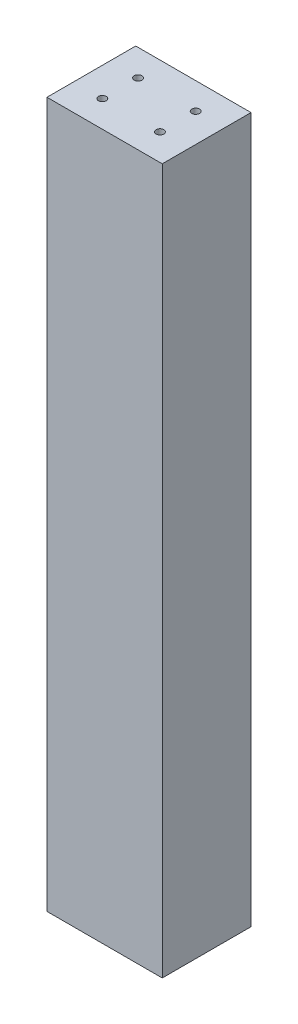
ISO-10303-21;
HEADER;
FILE_DESCRIPTION(('STEP AP214'),'2;1');
FILE_NAME('part.step','',(''),(''),'','','');
FILE_SCHEMA(('AUTOMOTIVE_DESIGN { 1 0 10303 214 1 1 1 1 }'));
ENDSEC;
DATA;
#1=APPLICATION_CONTEXT('core data for automotive mechanical design processes');
#2=APPLICATION_PROTOCOL_DEFINITION('international standard','automotive_design',2000,#1);
#3=PRODUCT_CONTEXT('',#1,'mechanical');
#4=PRODUCT('Part','Part','',(#3));
#5=PRODUCT_RELATED_PRODUCT_CATEGORY('part','',(#4));
#6=PRODUCT_DEFINITION_FORMATION('','',#4);
#7=PRODUCT_DEFINITION_CONTEXT('part definition',#1,'design');
#8=PRODUCT_DEFINITION('design','',#6,#7);
#9=PRODUCT_DEFINITION_SHAPE('','',#8);
#10=(LENGTH_UNIT() NAMED_UNIT(*) SI_UNIT(.MILLI.,.METRE.));
#11=(NAMED_UNIT(*) PLANE_ANGLE_UNIT() SI_UNIT($,.RADIAN.));
#12=(NAMED_UNIT(*) SI_UNIT($,.STERADIAN.) SOLID_ANGLE_UNIT());
#13=UNCERTAINTY_MEASURE_WITH_UNIT(LENGTH_MEASURE(1.E-05),#10,'distance_accuracy_value','');
#14=(GEOMETRIC_REPRESENTATION_CONTEXT(3) GLOBAL_UNCERTAINTY_ASSIGNED_CONTEXT((#13)) GLOBAL_UNIT_ASSIGNED_CONTEXT((#10,
#11,#12)) REPRESENTATION_CONTEXT('',''));
#15=CARTESIAN_POINT('',(0.,0.,0.));
#16=DIRECTION('',(0.,0.,1.));
#17=DIRECTION('',(1.,0.,0.));
#18=AXIS2_PLACEMENT_3D('',#15,#16,#17);
#19=CARTESIAN_POINT('',(0.,-466.09,0.));
#20=DIRECTION('',(-1.,0.,0.));
#21=DIRECTION('',(0.,0.,1.));
#22=AXIS2_PLACEMENT_3D('',#19,#20,#21);
#23=PLANE('',#22);
#24=DIRECTION('',(0.,0.,1.));
#25=VECTOR('',#24,1.);
#26=CARTESIAN_POINT('',(0.,0.,0.));
#27=LINE('',#26,#25);
#28=CARTESIAN_POINT('',(0.,0.,-58.674));
#29=VERTEX_POINT('',#28);
#30=CARTESIAN_POINT('',(0.,0.,0.));
#31=VERTEX_POINT('',#30);
#32=EDGE_CURVE('E103',#29,#31,#27,.T.);
#33=ORIENTED_EDGE('',*,*,#32,.F.);
#34=DIRECTION('',(0.,1.,0.));
#35=VECTOR('',#34,1.);
#36=CARTESIAN_POINT('',(0.,-466.09,-58.674));
#37=LINE('',#36,#35);
#38=CARTESIAN_POINT('',(0.,-466.09,-58.674));
#39=VERTEX_POINT('',#38);
#40=EDGE_CURVE('E11',#39,#29,#37,.T.);
#41=ORIENTED_EDGE('',*,*,#40,.F.);
#42=DIRECTION('',(0.,0.,1.));
#43=VECTOR('',#42,1.);
#44=CARTESIAN_POINT('',(0.,-466.09,0.));
#45=LINE('',#44,#43);
#46=CARTESIAN_POINT('',(0.,-466.09,0.));
#47=VERTEX_POINT('',#46);
#48=EDGE_CURVE('E96',#39,#47,#45,.T.);
#49=ORIENTED_EDGE('',*,*,#48,.T.);
#50=DIRECTION('',(0.,1.,0.));
#51=VECTOR('',#50,1.);
#52=CARTESIAN_POINT('',(0.,-466.09,0.));
#53=LINE('',#52,#51);
#54=EDGE_CURVE('E41',#47,#31,#53,.T.);
#55=ORIENTED_EDGE('',*,*,#54,.T.);
#56=EDGE_LOOP('',(#33,#41,#49,#55));
#57=FACE_BOUND('',#56,.T.);
#58=ADVANCED_FACE('F38',(#57),#23,.T.);
#59=CARTESIAN_POINT('',(0.,-466.09,-58.674));
#60=DIRECTION('',(0.,0.,-1.));
#61=DIRECTION('',(-1.,0.,0.));
#62=AXIS2_PLACEMENT_3D('',#59,#60,#61);
#63=PLANE('',#62);
#64=DIRECTION('',(-1.,0.,0.));
#65=VECTOR('',#64,1.);
#66=CARTESIAN_POINT('',(0.,0.,-58.674));
#67=LINE('',#66,#65);
#68=CARTESIAN_POINT('',(76.2,0.,-58.674));
#69=VERTEX_POINT('',#68);
#70=EDGE_CURVE('E98',#69,#29,#67,.T.);
#71=ORIENTED_EDGE('',*,*,#70,.F.);
#72=DIRECTION('',(0.,1.,0.));
#73=VECTOR('',#72,1.);
#74=CARTESIAN_POINT('',(76.2,-466.09,-58.674));
#75=LINE('',#74,#73);
#76=CARTESIAN_POINT('',(76.2,-466.09,-58.674));
#77=VERTEX_POINT('',#76);
#78=EDGE_CURVE('E47',#77,#69,#75,.T.);
#79=ORIENTED_EDGE('',*,*,#78,.F.);
#80=DIRECTION('',(-1.,0.,0.));
#81=VECTOR('',#80,1.);
#82=CARTESIAN_POINT('',(0.,-466.09,-58.674));
#83=LINE('',#82,#81);
#84=EDGE_CURVE('E93',#77,#39,#83,.T.);
#85=ORIENTED_EDGE('',*,*,#84,.T.);
#86=ORIENTED_EDGE('',*,*,#40,.T.);
#87=EDGE_LOOP('',(#71,#79,#85,#86));
#88=FACE_BOUND('',#87,.T.);
#89=ADVANCED_FACE('F114',(#88),#63,.T.);
#90=CARTESIAN_POINT('',(76.2,-466.09,0.));
#91=DIRECTION('',(1.,0.,0.));
#92=DIRECTION('',(0.,0.,-1.));
#93=AXIS2_PLACEMENT_3D('',#90,#91,#92);
#94=PLANE('',#93);
#95=DIRECTION('',(0.,0.,-1.));
#96=VECTOR('',#95,1.);
#97=CARTESIAN_POINT('',(76.2,0.,0.));
#98=LINE('',#97,#96);
#99=CARTESIAN_POINT('',(76.2,0.,0.));
#100=VERTEX_POINT('',#99);
#101=EDGE_CURVE('E88',#100,#69,#98,.T.);
#102=ORIENTED_EDGE('',*,*,#101,.F.);
#103=DIRECTION('',(0.,1.,0.));
#104=VECTOR('',#103,1.);
#105=CARTESIAN_POINT('',(76.2,-466.09,0.));
#106=LINE('',#105,#104);
#107=CARTESIAN_POINT('',(76.2,-466.09,0.));
#108=VERTEX_POINT('',#107);
#109=EDGE_CURVE('E83',#108,#100,#106,.T.);
#110=ORIENTED_EDGE('',*,*,#109,.F.);
#111=DIRECTION('',(0.,0.,-1.));
#112=VECTOR('',#111,1.);
#113=CARTESIAN_POINT('',(76.2,-466.09,0.));
#114=LINE('',#113,#112);
#115=EDGE_CURVE('E86',#108,#77,#114,.T.);
#116=ORIENTED_EDGE('',*,*,#115,.T.);
#117=ORIENTED_EDGE('',*,*,#78,.T.);
#118=EDGE_LOOP('',(#102,#110,#116,#117));
#119=FACE_BOUND('',#118,.T.);
#120=ADVANCED_FACE('F85',(#119),#94,.T.);
#121=CARTESIAN_POINT('',(0.,-466.09,0.));
#122=DIRECTION('',(0.,0.,1.));
#123=DIRECTION('',(1.,0.,0.));
#124=AXIS2_PLACEMENT_3D('',#121,#122,#123);
#125=PLANE('',#124);
#126=DIRECTION('',(1.,0.,0.));
#127=VECTOR('',#126,1.);
#128=CARTESIAN_POINT('',(0.,0.,0.));
#129=LINE('',#128,#127);
#130=EDGE_CURVE('E106',#31,#100,#129,.T.);
#131=ORIENTED_EDGE('',*,*,#130,.F.);
#132=ORIENTED_EDGE('',*,*,#54,.F.);
#133=DIRECTION('',(1.,0.,0.));
#134=VECTOR('',#133,1.);
#135=CARTESIAN_POINT('',(0.,-466.09,0.));
#136=LINE('',#135,#134);
#137=EDGE_CURVE('E92',#47,#108,#136,.T.);
#138=ORIENTED_EDGE('',*,*,#137,.T.);
#139=ORIENTED_EDGE('',*,*,#109,.T.);
#140=EDGE_LOOP('',(#131,#132,#138,#139));
#141=FACE_BOUND('',#140,.T.);
#142=ADVANCED_FACE('F95',(#141),#125,.T.);
#143=CARTESIAN_POINT('',(0.,-466.09,0.));
#144=DIRECTION('',(0.,-1.,0.));
#145=DIRECTION('',(0.,0.,-1.));
#146=AXIS2_PLACEMENT_3D('',#143,#144,#145);
#147=PLANE('',#146);
#148=CARTESIAN_POINT('',(57.15,-466.09,-41.148));
#149=DIRECTION('',(0.,1.,0.));
#150=DIRECTION('',(0.,0.,1.));
#151=AXIS2_PLACEMENT_3D('',#148,#149,#150);
#152=CIRCLE('',#151,2.55269999999989);
#153=CARTESIAN_POINT('',(57.15,-466.09,-38.5953000000001));
#154=VERTEX_POINT('',#153);
#155=EDGE_CURVE('E155',#154,#154,#152,.T.);
#156=ORIENTED_EDGE('',*,*,#155,.T.);
#157=EDGE_LOOP('',(#156));
#158=FACE_BOUND('',#157,.T.);
#159=CARTESIAN_POINT('',(57.15,-466.09,-17.526));
#160=DIRECTION('',(0.,1.,0.));
#161=DIRECTION('',(0.,0.,1.));
#162=AXIS2_PLACEMENT_3D('',#159,#160,#161);
#163=CIRCLE('',#162,2.55269999999989);
#164=CARTESIAN_POINT('',(57.15,-466.09,-14.9733000000001));
#165=VERTEX_POINT('',#164);
#166=EDGE_CURVE('E165',#165,#165,#163,.T.);
#167=ORIENTED_EDGE('',*,*,#166,.T.);
#168=EDGE_LOOP('',(#167));
#169=FACE_BOUND('',#168,.T.);
#170=CARTESIAN_POINT('',(19.05,-466.09,-41.148));
#171=DIRECTION('',(0.,1.,0.));
#172=DIRECTION('',(0.,0.,1.));
#173=AXIS2_PLACEMENT_3D('',#170,#171,#172);
#174=CIRCLE('',#173,2.55269999999989);
#175=CARTESIAN_POINT('',(19.05,-466.09,-38.5953000000001));
#176=VERTEX_POINT('',#175);
#177=EDGE_CURVE('E171',#176,#176,#174,.T.);
#178=ORIENTED_EDGE('',*,*,#177,.T.);
#179=EDGE_LOOP('',(#178));
#180=FACE_BOUND('',#179,.T.);
#181=CARTESIAN_POINT('',(19.05,-466.09,-17.526));
#182=DIRECTION('',(0.,1.,0.));
#183=DIRECTION('',(0.,0.,1.));
#184=AXIS2_PLACEMENT_3D('',#181,#182,#183);
#185=CIRCLE('',#184,2.55269999999989);
#186=CARTESIAN_POINT('',(19.05,-466.09,-14.9733000000001));
#187=VERTEX_POINT('',#186);
#188=EDGE_CURVE('E107',#187,#187,#185,.T.);
#189=ORIENTED_EDGE('',*,*,#188,.T.);
#190=EDGE_LOOP('',(#189));
#191=FACE_BOUND('',#190,.T.);
#192=ORIENTED_EDGE('',*,*,#48,.F.);
#193=ORIENTED_EDGE('',*,*,#84,.F.);
#194=ORIENTED_EDGE('',*,*,#115,.F.);
#195=ORIENTED_EDGE('',*,*,#137,.F.);
#196=EDGE_LOOP('',(#192,#193,#194,#195));
#197=FACE_BOUND('',#196,.T.);
#198=ADVANCED_FACE('F91',(#158,#169,#180,#191,#197),#147,.T.);
#199=CARTESIAN_POINT('',(0.,0.,0.));
#200=DIRECTION('',(0.,-1.,0.));
#201=DIRECTION('',(0.,0.,-1.));
#202=AXIS2_PLACEMENT_3D('',#199,#200,#201);
#203=PLANE('',#202);
#204=CARTESIAN_POINT('',(57.15,0.,-41.148));
#205=DIRECTION('',(0.,1.,0.));
#206=DIRECTION('',(0.,0.,1.));
#207=AXIS2_PLACEMENT_3D('',#204,#205,#206);
#208=CIRCLE('',#207,2.55269999999999);
#209=CARTESIAN_POINT('',(57.15,0.,-38.5953));
#210=VERTEX_POINT('',#209);
#211=EDGE_CURVE('E158',#210,#210,#208,.T.);
#212=ORIENTED_EDGE('',*,*,#211,.F.);
#213=EDGE_LOOP('',(#212));
#214=FACE_BOUND('',#213,.T.);
#215=CARTESIAN_POINT('',(57.15,0.,-17.526));
#216=DIRECTION('',(0.,1.,0.));
#217=DIRECTION('',(0.,0.,1.));
#218=AXIS2_PLACEMENT_3D('',#215,#216,#217);
#219=CIRCLE('',#218,2.55269999999999);
#220=CARTESIAN_POINT('',(57.15,0.,-14.9733));
#221=VERTEX_POINT('',#220);
#222=EDGE_CURVE('E160',#221,#221,#219,.T.);
#223=ORIENTED_EDGE('',*,*,#222,.F.);
#224=EDGE_LOOP('',(#223));
#225=FACE_BOUND('',#224,.T.);
#226=CARTESIAN_POINT('',(19.05,0.,-41.148));
#227=DIRECTION('',(0.,1.,0.));
#228=DIRECTION('',(0.,0.,1.));
#229=AXIS2_PLACEMENT_3D('',#226,#227,#228);
#230=CIRCLE('',#229,2.55269999999999);
#231=CARTESIAN_POINT('',(19.05,0.,-38.5953));
#232=VERTEX_POINT('',#231);
#233=EDGE_CURVE('E168',#232,#232,#230,.T.);
#234=ORIENTED_EDGE('',*,*,#233,.F.);
#235=EDGE_LOOP('',(#234));
#236=FACE_BOUND('',#235,.T.);
#237=CARTESIAN_POINT('',(19.05,0.,-17.526));
#238=DIRECTION('',(0.,1.,0.));
#239=DIRECTION('',(0.,0.,1.));
#240=AXIS2_PLACEMENT_3D('',#237,#238,#239);
#241=CIRCLE('',#240,2.55269999999999);
#242=CARTESIAN_POINT('',(19.05,0.,-14.9733));
#243=VERTEX_POINT('',#242);
#244=EDGE_CURVE('E174',#243,#243,#241,.T.);
#245=ORIENTED_EDGE('',*,*,#244,.F.);
#246=EDGE_LOOP('',(#245));
#247=FACE_BOUND('',#246,.T.);
#248=ORIENTED_EDGE('',*,*,#32,.T.);
#249=ORIENTED_EDGE('',*,*,#130,.T.);
#250=ORIENTED_EDGE('',*,*,#101,.T.);
#251=ORIENTED_EDGE('',*,*,#70,.T.);
#252=EDGE_LOOP('',(#248,#249,#250,#251));
#253=FACE_BOUND('',#252,.T.);
#254=ADVANCED_FACE('F113',(#214,#225,#236,#247,#253),#203,.F.);
#255=CARTESIAN_POINT('',(19.05,0.,-17.526));
#256=DIRECTION('',(0.,1.,0.));
#257=DIRECTION('',(0.,0.,1.));
#258=AXIS2_PLACEMENT_3D('',#255,#256,#257);
#259=CYLINDRICAL_SURFACE('',#258,2.55269999999994);
#260=ORIENTED_EDGE('',*,*,#188,.F.);
#261=EDGE_LOOP('',(#260));
#262=FACE_BOUND('',#261,.T.);
#263=ORIENTED_EDGE('',*,*,#244,.T.);
#264=EDGE_LOOP('',(#263));
#265=FACE_BOUND('',#264,.T.);
#266=ADVANCED_FACE('F132',(#262,#265),#259,.F.);
#267=CARTESIAN_POINT('',(19.05,0.,-41.148));
#268=DIRECTION('',(0.,1.,0.));
#269=DIRECTION('',(0.,0.,1.));
#270=AXIS2_PLACEMENT_3D('',#267,#268,#269);
#271=CYLINDRICAL_SURFACE('',#270,2.55269999999994);
#272=ORIENTED_EDGE('',*,*,#177,.F.);
#273=EDGE_LOOP('',(#272));
#274=FACE_BOUND('',#273,.T.);
#275=ORIENTED_EDGE('',*,*,#233,.T.);
#276=EDGE_LOOP('',(#275));
#277=FACE_BOUND('',#276,.T.);
#278=ADVANCED_FACE('F139',(#274,#277),#271,.F.);
#279=CARTESIAN_POINT('',(57.15,0.,-17.526));
#280=DIRECTION('',(0.,1.,0.));
#281=DIRECTION('',(0.,0.,1.));
#282=AXIS2_PLACEMENT_3D('',#279,#280,#281);
#283=CYLINDRICAL_SURFACE('',#282,2.55269999999994);
#284=ORIENTED_EDGE('',*,*,#166,.F.);
#285=EDGE_LOOP('',(#284));
#286=FACE_BOUND('',#285,.T.);
#287=ORIENTED_EDGE('',*,*,#222,.T.);
#288=EDGE_LOOP('',(#287));
#289=FACE_BOUND('',#288,.T.);
#290=ADVANCED_FACE('F143',(#286,#289),#283,.F.);
#291=CARTESIAN_POINT('',(57.15,0.,-41.148));
#292=DIRECTION('',(0.,1.,0.));
#293=DIRECTION('',(0.,0.,1.));
#294=AXIS2_PLACEMENT_3D('',#291,#292,#293);
#295=CYLINDRICAL_SURFACE('',#294,2.55269999999994);
#296=ORIENTED_EDGE('',*,*,#155,.F.);
#297=EDGE_LOOP('',(#296));
#298=FACE_BOUND('',#297,.T.);
#299=ORIENTED_EDGE('',*,*,#211,.T.);
#300=EDGE_LOOP('',(#299));
#301=FACE_BOUND('',#300,.T.);
#302=ADVANCED_FACE('F147',(#298,#301),#295,.F.);
#303=CLOSED_SHELL('',(#58,#89,#120,#142,#198,#254,#266,#278,#290,#302));
#304=MANIFOLD_SOLID_BREP('B2',#303);
#305=ADVANCED_BREP_SHAPE_REPRESENTATION('',(#18,#304),#14);
#306=SHAPE_DEFINITION_REPRESENTATION(#9,#305);
ENDSEC;
END-ISO-10303-21;
